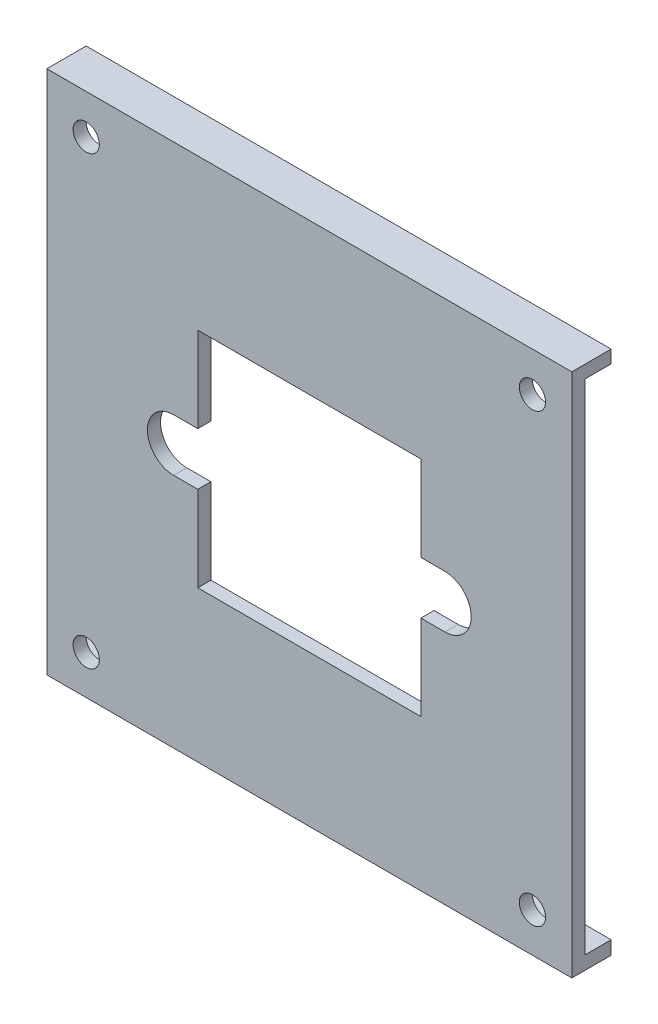
ISO-10303-21;
HEADER;
FILE_DESCRIPTION(('STEP AP214'),'2;1');
FILE_NAME('part.step','',(''),(''),'','','');
FILE_SCHEMA(('AUTOMOTIVE_DESIGN { 1 0 10303 214 1 1 1 1 }'));
ENDSEC;
DATA;
#1=APPLICATION_CONTEXT('core data for automotive mechanical design processes');
#2=APPLICATION_PROTOCOL_DEFINITION('international standard','automotive_design',2000,#1);
#3=PRODUCT_CONTEXT('',#1,'mechanical');
#4=PRODUCT('Part','Part','',(#3));
#5=PRODUCT_RELATED_PRODUCT_CATEGORY('part','',(#4));
#6=PRODUCT_DEFINITION_FORMATION('','',#4);
#7=PRODUCT_DEFINITION_CONTEXT('part definition',#1,'design');
#8=PRODUCT_DEFINITION('design','',#6,#7);
#9=PRODUCT_DEFINITION_SHAPE('','',#8);
#10=(LENGTH_UNIT() NAMED_UNIT(*) SI_UNIT(.MILLI.,.METRE.));
#11=(NAMED_UNIT(*) PLANE_ANGLE_UNIT() SI_UNIT($,.RADIAN.));
#12=(NAMED_UNIT(*) SI_UNIT($,.STERADIAN.) SOLID_ANGLE_UNIT());
#13=UNCERTAINTY_MEASURE_WITH_UNIT(LENGTH_MEASURE(1.E-05),#10,'distance_accuracy_value','');
#14=(GEOMETRIC_REPRESENTATION_CONTEXT(3) GLOBAL_UNCERTAINTY_ASSIGNED_CONTEXT((#13)) GLOBAL_UNIT_ASSIGNED_CONTEXT((#10,
#11,#12)) REPRESENTATION_CONTEXT('',''));
#15=CARTESIAN_POINT('',(0.,0.,0.));
#16=DIRECTION('',(0.,0.,1.));
#17=DIRECTION('',(1.,0.,0.));
#18=AXIS2_PLACEMENT_3D('',#15,#16,#17);
#19=CARTESIAN_POINT('',(28.5,28.5,10.));
#20=DIRECTION('',(1.,0.,0.));
#21=DIRECTION('',(0.,0.,-1.));
#22=AXIS2_PLACEMENT_3D('',#19,#20,#21);
#23=PLANE('',#22);
#24=DIRECTION('',(0.,-1.,0.));
#25=VECTOR('',#24,1.);
#26=CARTESIAN_POINT('',(28.5,28.5,2.));
#27=LINE('',#26,#25);
#28=CARTESIAN_POINT('',(28.5,28.5,2.));
#29=VERTEX_POINT('',#28);
#30=CARTESIAN_POINT('',(28.5,22.,2.));
#31=VERTEX_POINT('',#30);
#32=EDGE_CURVE('E336',#29,#31,#27,.T.);
#33=ORIENTED_EDGE('',*,*,#32,.T.);
#34=DIRECTION('',(0.,0.,1.));
#35=VECTOR('',#34,1.);
#36=CARTESIAN_POINT('',(28.5,22.,0.));
#37=LINE('',#36,#35);
#38=CARTESIAN_POINT('',(28.5,22.,3.));
#39=VERTEX_POINT('',#38);
#40=EDGE_CURVE('E194',#31,#39,#37,.T.);
#41=ORIENTED_EDGE('',*,*,#40,.T.);
#42=DIRECTION('',(0.,-1.,0.));
#43=VECTOR('',#42,1.);
#44=CARTESIAN_POINT('',(28.5,0.,3.));
#45=LINE('',#44,#43);
#46=CARTESIAN_POINT('',(28.5,28.5,3.));
#47=VERTEX_POINT('',#46);
#48=EDGE_CURVE('E211',#47,#39,#45,.T.);
#49=ORIENTED_EDGE('',*,*,#48,.F.);
#50=DIRECTION('',(0.,0.,-1.));
#51=VECTOR('',#50,1.);
#52=CARTESIAN_POINT('',(28.5,28.5,10.));
#53=LINE('',#52,#51);
#54=EDGE_CURVE('E205',#47,#29,#53,.T.);
#55=ORIENTED_EDGE('',*,*,#54,.T.);
#56=EDGE_LOOP('',(#33,#41,#49,#55));
#57=FACE_BOUND('',#56,.T.);
#58=ADVANCED_FACE('F37',(#57),#23,.F.);
#59=CARTESIAN_POINT('',(11.5,28.5,10.));
#60=DIRECTION('',(-1.,0.,0.));
#61=DIRECTION('',(0.,-1.,0.));
#62=AXIS2_PLACEMENT_3D('',#59,#60,#61);
#63=PLANE('',#62);
#64=DIRECTION('',(0.,1.,0.));
#65=VECTOR('',#64,1.);
#66=CARTESIAN_POINT('',(11.5,28.5,2.));
#67=LINE('',#66,#65);
#68=CARTESIAN_POINT('',(11.5,11.5,2.));
#69=VERTEX_POINT('',#68);
#70=CARTESIAN_POINT('',(11.5,18.,2.));
#71=VERTEX_POINT('',#70);
#72=EDGE_CURVE('E330',#69,#71,#67,.T.);
#73=ORIENTED_EDGE('',*,*,#72,.T.);
#74=DIRECTION('',(0.,0.,1.));
#75=VECTOR('',#74,1.);
#76=CARTESIAN_POINT('',(11.5,18.,0.));
#77=LINE('',#76,#75);
#78=CARTESIAN_POINT('',(11.5,18.,3.));
#79=VERTEX_POINT('',#78);
#80=EDGE_CURVE('E282',#71,#79,#77,.T.);
#81=ORIENTED_EDGE('',*,*,#80,.T.);
#82=DIRECTION('',(0.,1.,0.));
#83=VECTOR('',#82,1.);
#84=CARTESIAN_POINT('',(11.5,0.,3.));
#85=LINE('',#84,#83);
#86=CARTESIAN_POINT('',(11.5,11.5,3.));
#87=VERTEX_POINT('',#86);
#88=EDGE_CURVE('E200',#87,#79,#85,.T.);
#89=ORIENTED_EDGE('',*,*,#88,.F.);
#90=DIRECTION('',(0.,0.,-1.));
#91=VECTOR('',#90,1.);
#92=CARTESIAN_POINT('',(11.5,11.5,10.));
#93=LINE('',#92,#91);
#94=EDGE_CURVE('E355',#87,#69,#93,.T.);
#95=ORIENTED_EDGE('',*,*,#94,.T.);
#96=EDGE_LOOP('',(#73,#81,#89,#95));
#97=FACE_BOUND('',#96,.T.);
#98=ADVANCED_FACE('F369',(#97),#63,.F.);
#99=CARTESIAN_POINT('',(0.,0.,0.));
#100=DIRECTION('',(0.,0.,-1.));
#101=DIRECTION('',(-1.,0.,0.));
#102=AXIS2_PLACEMENT_3D('',#99,#100,#101);
#103=PLANE('',#102);
#104=DIRECTION('',(1.,0.,0.));
#105=VECTOR('',#104,1.);
#106=CARTESIAN_POINT('',(0.,1.02489497807123,0.));
#107=LINE('',#106,#105);
#108=CARTESIAN_POINT('',(0.,1.02489497807123,0.));
#109=VERTEX_POINT('',#108);
#110=CARTESIAN_POINT('',(40.,1.02489497807124,0.));
#111=VERTEX_POINT('',#110);
#112=EDGE_CURVE('E321',#109,#111,#107,.T.);
#113=ORIENTED_EDGE('',*,*,#112,.T.);
#114=DIRECTION('',(0.,1.,0.));
#115=VECTOR('',#114,1.);
#116=CARTESIAN_POINT('',(40.,40.,0.));
#117=LINE('',#116,#115);
#118=CARTESIAN_POINT('',(40.,0.,0.));
#119=VERTEX_POINT('',#118);
#120=EDGE_CURVE('E241',#119,#111,#117,.T.);
#121=ORIENTED_EDGE('',*,*,#120,.F.);
#122=DIRECTION('',(1.,0.,0.));
#123=VECTOR('',#122,1.);
#124=CARTESIAN_POINT('',(40.,0.,0.));
#125=LINE('',#124,#123);
#126=CARTESIAN_POINT('',(0.,0.,0.));
#127=VERTEX_POINT('',#126);
#128=EDGE_CURVE('E226',#127,#119,#125,.T.);
#129=ORIENTED_EDGE('',*,*,#128,.F.);
#130=DIRECTION('',(0.,-1.,0.));
#131=VECTOR('',#130,1.);
#132=CARTESIAN_POINT('',(0.,0.,0.));
#133=LINE('',#132,#131);
#134=EDGE_CURVE('E246',#109,#127,#133,.T.);
#135=ORIENTED_EDGE('',*,*,#134,.F.);
#136=EDGE_LOOP('',(#113,#121,#129,#135));
#137=FACE_BOUND('',#136,.T.);
#138=ADVANCED_FACE('F399',(#137),#103,.T.);
#139=CARTESIAN_POINT('',(40.,0.,3.));
#140=DIRECTION('',(0.,1.,0.));
#141=DIRECTION('',(-1.,0.,0.));
#142=AXIS2_PLACEMENT_3D('',#139,#140,#141);
#143=PLANE('',#142);
#144=ORIENTED_EDGE('',*,*,#128,.T.);
#145=DIRECTION('',(0.,0.,-1.));
#146=VECTOR('',#145,1.);
#147=CARTESIAN_POINT('',(40.,0.,3.));
#148=LINE('',#147,#146);
#149=CARTESIAN_POINT('',(40.,0.,3.));
#150=VERTEX_POINT('',#149);
#151=EDGE_CURVE('E257',#150,#119,#148,.T.);
#152=ORIENTED_EDGE('',*,*,#151,.F.);
#153=DIRECTION('',(1.,0.,0.));
#154=VECTOR('',#153,1.);
#155=CARTESIAN_POINT('',(40.,0.,3.));
#156=LINE('',#155,#154);
#157=CARTESIAN_POINT('',(0.,0.,3.));
#158=VERTEX_POINT('',#157);
#159=EDGE_CURVE('E227',#158,#150,#156,.T.);
#160=ORIENTED_EDGE('',*,*,#159,.F.);
#161=DIRECTION('',(0.,0.,-1.));
#162=VECTOR('',#161,1.);
#163=CARTESIAN_POINT('',(0.,0.,3.));
#164=LINE('',#163,#162);
#165=EDGE_CURVE('E237',#158,#127,#164,.T.);
#166=ORIENTED_EDGE('',*,*,#165,.T.);
#167=EDGE_LOOP('',(#144,#152,#160,#166));
#168=FACE_BOUND('',#167,.T.);
#169=ADVANCED_FACE('F39',(#168),#143,.F.);
#170=CARTESIAN_POINT('',(40.,40.,3.));
#171=DIRECTION('',(-1.,0.,0.));
#172=DIRECTION('',(0.,-1.,0.));
#173=AXIS2_PLACEMENT_3D('',#170,#171,#172);
#174=PLANE('',#173);
#175=ORIENTED_EDGE('',*,*,#120,.T.);
#176=DIRECTION('',(0.,0.,-1.));
#177=VECTOR('',#176,1.);
#178=CARTESIAN_POINT('',(40.,1.02489497807124,2.));
#179=LINE('',#178,#177);
#180=CARTESIAN_POINT('',(40.,1.02489497807124,2.));
#181=VERTEX_POINT('',#180);
#182=EDGE_CURVE('E308',#181,#111,#179,.T.);
#183=ORIENTED_EDGE('',*,*,#182,.F.);
#184=DIRECTION('',(0.,-1.,0.));
#185=VECTOR('',#184,1.);
#186=CARTESIAN_POINT('',(40.,39.0248949780712,2.));
#187=LINE('',#186,#185);
#188=CARTESIAN_POINT('',(40.,39.0248949780712,2.));
#189=VERTEX_POINT('',#188);
#190=EDGE_CURVE('E317',#189,#181,#187,.T.);
#191=ORIENTED_EDGE('',*,*,#190,.F.);
#192=DIRECTION('',(0.,0.,1.));
#193=VECTOR('',#192,1.);
#194=CARTESIAN_POINT('',(40.,39.0248949780712,0.));
#195=LINE('',#194,#193);
#196=CARTESIAN_POINT('',(40.,39.0248949780712,0.));
#197=VERTEX_POINT('',#196);
#198=EDGE_CURVE('E285',#197,#189,#195,.T.);
#199=ORIENTED_EDGE('',*,*,#198,.F.);
#200=CARTESIAN_POINT('',(40.,40.,0.));
#201=VERTEX_POINT('',#200);
#202=EDGE_CURVE('E240',#197,#201,#117,.T.);
#203=ORIENTED_EDGE('',*,*,#202,.T.);
#204=DIRECTION('',(0.,0.,-1.));
#205=VECTOR('',#204,1.);
#206=CARTESIAN_POINT('',(40.,40.,3.));
#207=LINE('',#206,#205);
#208=CARTESIAN_POINT('',(40.,40.,3.));
#209=VERTEX_POINT('',#208);
#210=EDGE_CURVE('E254',#209,#201,#207,.T.);
#211=ORIENTED_EDGE('',*,*,#210,.F.);
#212=DIRECTION('',(0.,1.,0.));
#213=VECTOR('',#212,1.);
#214=CARTESIAN_POINT('',(40.,40.,3.));
#215=LINE('',#214,#213);
#216=EDGE_CURVE('E230',#150,#209,#215,.T.);
#217=ORIENTED_EDGE('',*,*,#216,.F.);
#218=ORIENTED_EDGE('',*,*,#151,.T.);
#219=EDGE_LOOP('',(#175,#183,#191,#199,#203,#211,#217,#218));
#220=FACE_BOUND('',#219,.T.);
#221=ADVANCED_FACE('F429',(#220),#174,.F.);
#222=CARTESIAN_POINT('',(0.,40.,3.));
#223=DIRECTION('',(0.,-1.,0.));
#224=DIRECTION('',(0.,0.,-1.));
#225=AXIS2_PLACEMENT_3D('',#222,#223,#224);
#226=PLANE('',#225);
#227=DIRECTION('',(-1.,0.,0.));
#228=VECTOR('',#227,1.);
#229=CARTESIAN_POINT('',(0.,40.,0.));
#230=LINE('',#229,#228);
#231=CARTESIAN_POINT('',(0.,40.,0.));
#232=VERTEX_POINT('',#231);
#233=EDGE_CURVE('E244',#201,#232,#230,.T.);
#234=ORIENTED_EDGE('',*,*,#233,.T.);
#235=DIRECTION('',(0.,0.,-1.));
#236=VECTOR('',#235,1.);
#237=CARTESIAN_POINT('',(0.,40.,3.));
#238=LINE('',#237,#236);
#239=CARTESIAN_POINT('',(0.,40.,3.));
#240=VERTEX_POINT('',#239);
#241=EDGE_CURVE('E251',#240,#232,#238,.T.);
#242=ORIENTED_EDGE('',*,*,#241,.F.);
#243=DIRECTION('',(-1.,0.,0.));
#244=VECTOR('',#243,1.);
#245=CARTESIAN_POINT('',(0.,40.,3.));
#246=LINE('',#245,#244);
#247=EDGE_CURVE('E233',#209,#240,#246,.T.);
#248=ORIENTED_EDGE('',*,*,#247,.F.);
#249=ORIENTED_EDGE('',*,*,#210,.T.);
#250=EDGE_LOOP('',(#234,#242,#248,#249));
#251=FACE_BOUND('',#250,.T.);
#252=ADVANCED_FACE('F426',(#251),#226,.F.);
#253=CARTESIAN_POINT('',(0.,0.,3.));
#254=DIRECTION('',(1.,0.,0.));
#255=DIRECTION('',(0.,0.,-1.));
#256=AXIS2_PLACEMENT_3D('',#253,#254,#255);
#257=PLANE('',#256);
#258=DIRECTION('',(0.,-1.,0.));
#259=VECTOR('',#258,1.);
#260=CARTESIAN_POINT('',(0.,39.0248949780712,2.));
#261=LINE('',#260,#259);
#262=CARTESIAN_POINT('',(0.,39.0248949780712,2.));
#263=VERTEX_POINT('',#262);
#264=CARTESIAN_POINT('',(0.,1.02489497807123,2.));
#265=VERTEX_POINT('',#264);
#266=EDGE_CURVE('E307',#263,#265,#261,.T.);
#267=ORIENTED_EDGE('',*,*,#266,.T.);
#268=DIRECTION('',(0.,0.,-1.));
#269=VECTOR('',#268,1.);
#270=CARTESIAN_POINT('',(0.,1.02489497807123,2.));
#271=LINE('',#270,#269);
#272=EDGE_CURVE('E311',#265,#109,#271,.T.);
#273=ORIENTED_EDGE('',*,*,#272,.T.);
#274=ORIENTED_EDGE('',*,*,#134,.T.);
#275=ORIENTED_EDGE('',*,*,#165,.F.);
#276=DIRECTION('',(0.,-1.,0.));
#277=VECTOR('',#276,1.);
#278=CARTESIAN_POINT('',(0.,0.,3.));
#279=LINE('',#278,#277);
#280=EDGE_CURVE('E235',#240,#158,#279,.T.);
#281=ORIENTED_EDGE('',*,*,#280,.F.);
#282=ORIENTED_EDGE('',*,*,#241,.T.);
#283=CARTESIAN_POINT('',(0.,39.0248949780712,0.));
#284=VERTEX_POINT('',#283);
#285=EDGE_CURVE('E231',#232,#284,#133,.T.);
#286=ORIENTED_EDGE('',*,*,#285,.T.);
#287=DIRECTION('',(0.,0.,1.));
#288=VECTOR('',#287,1.);
#289=CARTESIAN_POINT('',(0.,39.0248949780712,0.));
#290=LINE('',#289,#288);
#291=EDGE_CURVE('E304',#284,#263,#290,.T.);
#292=ORIENTED_EDGE('',*,*,#291,.T.);
#293=EDGE_LOOP('',(#267,#273,#274,#275,#281,#282,#286,#292));
#294=FACE_BOUND('',#293,.T.);
#295=ADVANCED_FACE('F420',(#294),#257,.F.);
#296=CARTESIAN_POINT('',(0.,0.,3.));
#297=DIRECTION('',(0.,0.,-1.));
#298=DIRECTION('',(-1.,0.,0.));
#299=AXIS2_PLACEMENT_3D('',#296,#297,#298);
#300=PLANE('',#299);
#301=ORIENTED_EDGE('',*,*,#88,.T.);
#302=DIRECTION('',(1.,0.,0.));
#303=VECTOR('',#302,1.);
#304=CARTESIAN_POINT('',(11.5,18.,3.));
#305=LINE('',#304,#303);
#306=CARTESIAN_POINT('',(9.66485434975057,18.,3.));
#307=VERTEX_POINT('',#306);
#308=EDGE_CURVE('E182',#307,#79,#305,.T.);
#309=ORIENTED_EDGE('',*,*,#308,.F.);
#310=CARTESIAN_POINT('',(9.66485434975057,20.,3.));
#311=DIRECTION('',(0.,0.,1.));
#312=DIRECTION('',(1.,0.,0.));
#313=AXIS2_PLACEMENT_3D('',#310,#311,#312);
#314=CIRCLE('',#313,2.);
#315=CARTESIAN_POINT('',(9.66485434975057,22.,3.));
#316=VERTEX_POINT('',#315);
#317=EDGE_CURVE('E193',#316,#307,#314,.T.);
#318=ORIENTED_EDGE('',*,*,#317,.F.);
#319=DIRECTION('',(-1.,0.,0.));
#320=VECTOR('',#319,1.);
#321=CARTESIAN_POINT('',(11.5,22.,3.));
#322=LINE('',#321,#320);
#323=CARTESIAN_POINT('',(11.5,22.,3.));
#324=VERTEX_POINT('',#323);
#325=EDGE_CURVE('E175',#324,#316,#322,.T.);
#326=ORIENTED_EDGE('',*,*,#325,.F.);
#327=CARTESIAN_POINT('',(11.5,28.5,3.));
#328=VERTEX_POINT('',#327);
#329=EDGE_CURVE('E189',#324,#328,#85,.T.);
#330=ORIENTED_EDGE('',*,*,#329,.T.);
#331=DIRECTION('',(1.,0.,0.));
#332=VECTOR('',#331,1.);
#333=CARTESIAN_POINT('',(0.,28.5,3.));
#334=LINE('',#333,#332);
#335=EDGE_CURVE('E203',#328,#47,#334,.T.);
#336=ORIENTED_EDGE('',*,*,#335,.T.);
#337=ORIENTED_EDGE('',*,*,#48,.T.);
#338=DIRECTION('',(-1.,0.,0.));
#339=VECTOR('',#338,1.);
#340=CARTESIAN_POINT('',(28.5,22.,3.));
#341=LINE('',#340,#339);
#342=CARTESIAN_POINT('',(30.3351456502494,22.,3.));
#343=VERTEX_POINT('',#342);
#344=EDGE_CURVE('E295',#343,#39,#341,.T.);
#345=ORIENTED_EDGE('',*,*,#344,.F.);
#346=CARTESIAN_POINT('',(30.3351456502494,20.,3.));
#347=DIRECTION('',(0.,0.,1.));
#348=DIRECTION('',(-1.,0.,0.));
#349=AXIS2_PLACEMENT_3D('',#346,#347,#348);
#350=CIRCLE('',#349,2.);
#351=CARTESIAN_POINT('',(30.3351456502494,18.,3.));
#352=VERTEX_POINT('',#351);
#353=EDGE_CURVE('E292',#352,#343,#350,.T.);
#354=ORIENTED_EDGE('',*,*,#353,.F.);
#355=DIRECTION('',(1.,0.,0.));
#356=VECTOR('',#355,1.);
#357=CARTESIAN_POINT('',(28.5,18.,3.));
#358=LINE('',#357,#356);
#359=CARTESIAN_POINT('',(28.5,18.,3.));
#360=VERTEX_POINT('',#359);
#361=EDGE_CURVE('E290',#360,#352,#358,.T.);
#362=ORIENTED_EDGE('',*,*,#361,.F.);
#363=CARTESIAN_POINT('',(28.5,11.5,3.));
#364=VERTEX_POINT('',#363);
#365=EDGE_CURVE('E210',#360,#364,#45,.T.);
#366=ORIENTED_EDGE('',*,*,#365,.T.);
#367=DIRECTION('',(-1.,0.,0.));
#368=VECTOR('',#367,1.);
#369=CARTESIAN_POINT('',(0.,11.5,3.));
#370=LINE('',#369,#368);
#371=EDGE_CURVE('E201',#364,#87,#370,.T.);
#372=ORIENTED_EDGE('',*,*,#371,.T.);
#373=EDGE_LOOP('',(#301,#309,#318,#326,#330,#336,#337,#345,#354,#362,#366,#372));
#374=FACE_BOUND('',#373,.T.);
#375=CARTESIAN_POINT('',(3.,3.,3.));
#376=DIRECTION('',(0.,0.,1.));
#377=DIRECTION('',(1.,0.,0.));
#378=AXIS2_PLACEMENT_3D('',#375,#376,#377);
#379=CIRCLE('',#378,1.);
#380=CARTESIAN_POINT('',(4.,3.,3.));
#381=VERTEX_POINT('',#380);
#382=EDGE_CURVE('E218',#381,#381,#379,.T.);
#383=ORIENTED_EDGE('',*,*,#382,.F.);
#384=EDGE_LOOP('',(#383));
#385=FACE_BOUND('',#384,.T.);
#386=CARTESIAN_POINT('',(37.,37.,3.));
#387=DIRECTION('',(0.,0.,1.));
#388=DIRECTION('',(1.,0.,0.));
#389=AXIS2_PLACEMENT_3D('',#386,#387,#388);
#390=CIRCLE('',#389,0.999999999999998);
#391=CARTESIAN_POINT('',(38.,37.,3.));
#392=VERTEX_POINT('',#391);
#393=EDGE_CURVE('E217',#392,#392,#390,.T.);
#394=ORIENTED_EDGE('',*,*,#393,.F.);
#395=EDGE_LOOP('',(#394));
#396=FACE_BOUND('',#395,.T.);
#397=CARTESIAN_POINT('',(37.,3.,3.));
#398=DIRECTION('',(0.,0.,1.));
#399=DIRECTION('',(1.,0.,0.));
#400=AXIS2_PLACEMENT_3D('',#397,#398,#399);
#401=CIRCLE('',#400,0.999999999999998);
#402=CARTESIAN_POINT('',(38.,3.,3.));
#403=VERTEX_POINT('',#402);
#404=EDGE_CURVE('E214',#403,#403,#401,.T.);
#405=ORIENTED_EDGE('',*,*,#404,.F.);
#406=EDGE_LOOP('',(#405));
#407=FACE_BOUND('',#406,.T.);
#408=CARTESIAN_POINT('',(3.,37.,3.));
#409=DIRECTION('',(0.,0.,1.));
#410=DIRECTION('',(1.,0.,0.));
#411=AXIS2_PLACEMENT_3D('',#408,#409,#410);
#412=CIRCLE('',#411,1.);
#413=CARTESIAN_POINT('',(4.,37.,3.));
#414=VERTEX_POINT('',#413);
#415=EDGE_CURVE('E221',#414,#414,#412,.T.);
#416=ORIENTED_EDGE('',*,*,#415,.F.);
#417=EDGE_LOOP('',(#416));
#418=FACE_BOUND('',#417,.T.);
#419=ORIENTED_EDGE('',*,*,#159,.T.);
#420=ORIENTED_EDGE('',*,*,#216,.T.);
#421=ORIENTED_EDGE('',*,*,#247,.T.);
#422=ORIENTED_EDGE('',*,*,#280,.T.);
#423=EDGE_LOOP('',(#419,#420,#421,#422));
#424=FACE_BOUND('',#423,.T.);
#425=ADVANCED_FACE('F186',(#374,#385,#396,#407,#418,#424),#300,.F.);
#426=DIRECTION('',(1.,0.,0.));
#427=VECTOR('',#426,1.);
#428=CARTESIAN_POINT('',(0.,39.0248949780712,0.));
#429=LINE('',#428,#427);
#430=EDGE_CURVE('E314',#284,#197,#429,.T.);
#431=ORIENTED_EDGE('',*,*,#430,.F.);
#432=ORIENTED_EDGE('',*,*,#285,.F.);
#433=ORIENTED_EDGE('',*,*,#233,.F.);
#434=ORIENTED_EDGE('',*,*,#202,.F.);
#435=EDGE_LOOP('',(#431,#432,#433,#434));
#436=FACE_BOUND('',#435,.T.);
#437=ADVANCED_FACE('F416',(#436),#103,.T.);
#438=CARTESIAN_POINT('',(3.,37.,-7.));
#439=DIRECTION('',(0.,0.,1.));
#440=DIRECTION('',(1.,0.,0.));
#441=AXIS2_PLACEMENT_3D('',#438,#439,#440);
#442=CYLINDRICAL_SURFACE('',#441,1.);
#443=CARTESIAN_POINT('',(3.,37.,2.));
#444=DIRECTION('',(0.,0.,1.));
#445=DIRECTION('',(0.,-1.,0.));
#446=AXIS2_PLACEMENT_3D('',#443,#444,#445);
#447=CIRCLE('',#446,1.);
#448=CARTESIAN_POINT('',(3.,36.,2.));
#449=VERTEX_POINT('',#448);
#450=EDGE_CURVE('E348',#449,#449,#447,.F.);
#451=ORIENTED_EDGE('',*,*,#450,.T.);
#452=EDGE_LOOP('',(#451));
#453=FACE_BOUND('',#452,.T.);
#454=ORIENTED_EDGE('',*,*,#415,.T.);
#455=EDGE_LOOP('',(#454));
#456=FACE_BOUND('',#455,.T.);
#457=ADVANCED_FACE('F406',(#453,#456),#442,.F.);
#458=CARTESIAN_POINT('',(37.,3.,-7.));
#459=DIRECTION('',(0.,0.,1.));
#460=DIRECTION('',(1.,0.,0.));
#461=AXIS2_PLACEMENT_3D('',#458,#459,#460);
#462=CYLINDRICAL_SURFACE('',#461,0.999999999999998);
#463=CARTESIAN_POINT('',(37.,3.,2.));
#464=DIRECTION('',(0.,0.,1.));
#465=DIRECTION('',(0.,-1.,0.));
#466=AXIS2_PLACEMENT_3D('',#463,#464,#465);
#467=CIRCLE('',#466,0.999999999999998);
#468=CARTESIAN_POINT('',(37.,2.,2.));
#469=VERTEX_POINT('',#468);
#470=EDGE_CURVE('E345',#469,#469,#467,.F.);
#471=ORIENTED_EDGE('',*,*,#470,.T.);
#472=EDGE_LOOP('',(#471));
#473=FACE_BOUND('',#472,.T.);
#474=ORIENTED_EDGE('',*,*,#404,.T.);
#475=EDGE_LOOP('',(#474));
#476=FACE_BOUND('',#475,.T.);
#477=ADVANCED_FACE('F402',(#473,#476),#462,.F.);
#478=CARTESIAN_POINT('',(37.,37.,-7.));
#479=DIRECTION('',(0.,0.,1.));
#480=DIRECTION('',(1.,0.,0.));
#481=AXIS2_PLACEMENT_3D('',#478,#479,#480);
#482=CYLINDRICAL_SURFACE('',#481,0.999999999999998);
#483=CARTESIAN_POINT('',(37.,37.,2.));
#484=DIRECTION('',(0.,0.,1.));
#485=DIRECTION('',(0.,-1.,0.));
#486=AXIS2_PLACEMENT_3D('',#483,#484,#485);
#487=CIRCLE('',#486,0.999999999999998);
#488=CARTESIAN_POINT('',(37.,36.,2.));
#489=VERTEX_POINT('',#488);
#490=EDGE_CURVE('E342',#489,#489,#487,.F.);
#491=ORIENTED_EDGE('',*,*,#490,.T.);
#492=EDGE_LOOP('',(#491));
#493=FACE_BOUND('',#492,.T.);
#494=ORIENTED_EDGE('',*,*,#393,.T.);
#495=EDGE_LOOP('',(#494));
#496=FACE_BOUND('',#495,.T.);
#497=ADVANCED_FACE('F405',(#493,#496),#482,.F.);
#498=CARTESIAN_POINT('',(3.,3.,-7.));
#499=DIRECTION('',(0.,0.,1.));
#500=DIRECTION('',(1.,0.,0.));
#501=AXIS2_PLACEMENT_3D('',#498,#499,#500);
#502=CYLINDRICAL_SURFACE('',#501,1.);
#503=CARTESIAN_POINT('',(3.,3.,2.));
#504=DIRECTION('',(0.,0.,1.));
#505=DIRECTION('',(0.,-1.,0.));
#506=AXIS2_PLACEMENT_3D('',#503,#504,#505);
#507=CIRCLE('',#506,1.);
#508=CARTESIAN_POINT('',(3.,2.,2.));
#509=VERTEX_POINT('',#508);
#510=EDGE_CURVE('E339',#509,#509,#507,.F.);
#511=ORIENTED_EDGE('',*,*,#510,.T.);
#512=EDGE_LOOP('',(#511));
#513=FACE_BOUND('',#512,.T.);
#514=ORIENTED_EDGE('',*,*,#382,.T.);
#515=EDGE_LOOP('',(#514));
#516=FACE_BOUND('',#515,.T.);
#517=ADVANCED_FACE('F392',(#513,#516),#502,.F.);
#518=ORIENTED_EDGE('',*,*,#365,.F.);
#519=DIRECTION('',(0.,0.,1.));
#520=VECTOR('',#519,1.);
#521=CARTESIAN_POINT('',(28.5,18.,0.));
#522=LINE('',#521,#520);
#523=CARTESIAN_POINT('',(28.5,18.,2.));
#524=VERTEX_POINT('',#523);
#525=EDGE_CURVE('E297',#524,#360,#522,.T.);
#526=ORIENTED_EDGE('',*,*,#525,.F.);
#527=CARTESIAN_POINT('',(28.5,11.5,2.));
#528=VERTEX_POINT('',#527);
#529=EDGE_CURVE('E335',#524,#528,#27,.T.);
#530=ORIENTED_EDGE('',*,*,#529,.T.);
#531=DIRECTION('',(0.,0.,-1.));
#532=VECTOR('',#531,1.);
#533=CARTESIAN_POINT('',(28.5,11.5,10.));
#534=LINE('',#533,#532);
#535=EDGE_CURVE('E351',#364,#528,#534,.T.);
#536=ORIENTED_EDGE('',*,*,#535,.F.);
#537=EDGE_LOOP('',(#518,#526,#530,#536));
#538=FACE_BOUND('',#537,.T.);
#539=ADVANCED_FACE('F365',(#538),#23,.F.);
#540=CARTESIAN_POINT('',(28.5,28.5,10.));
#541=DIRECTION('',(0.,1.,0.));
#542=DIRECTION('',(0.,0.,1.));
#543=AXIS2_PLACEMENT_3D('',#540,#541,#542);
#544=PLANE('',#543);
#545=DIRECTION('',(0.,0.,-1.));
#546=VECTOR('',#545,1.);
#547=CARTESIAN_POINT('',(11.5,28.5,10.));
#548=LINE('',#547,#546);
#549=CARTESIAN_POINT('',(11.5,28.5,2.));
#550=VERTEX_POINT('',#549);
#551=EDGE_CURVE('E199',#328,#550,#548,.T.);
#552=ORIENTED_EDGE('',*,*,#551,.T.);
#553=DIRECTION('',(1.,0.,0.));
#554=VECTOR('',#553,1.);
#555=CARTESIAN_POINT('',(28.5,28.5,2.));
#556=LINE('',#555,#554);
#557=EDGE_CURVE('E332',#550,#29,#556,.T.);
#558=ORIENTED_EDGE('',*,*,#557,.T.);
#559=ORIENTED_EDGE('',*,*,#54,.F.);
#560=ORIENTED_EDGE('',*,*,#335,.F.);
#561=EDGE_LOOP('',(#552,#558,#559,#560));
#562=FACE_BOUND('',#561,.T.);
#563=ADVANCED_FACE('F383',(#562),#544,.F.);
#564=ORIENTED_EDGE('',*,*,#329,.F.);
#565=DIRECTION('',(0.,0.,1.));
#566=VECTOR('',#565,1.);
#567=CARTESIAN_POINT('',(11.5,22.,0.));
#568=LINE('',#567,#566);
#569=CARTESIAN_POINT('',(11.5,22.,2.));
#570=VERTEX_POINT('',#569);
#571=EDGE_CURVE('E172',#570,#324,#568,.T.);
#572=ORIENTED_EDGE('',*,*,#571,.F.);
#573=EDGE_CURVE('E324',#570,#550,#67,.T.);
#574=ORIENTED_EDGE('',*,*,#573,.T.);
#575=ORIENTED_EDGE('',*,*,#551,.F.);
#576=EDGE_LOOP('',(#564,#572,#574,#575));
#577=FACE_BOUND('',#576,.T.);
#578=ADVANCED_FACE('F197',(#577),#63,.F.);
#579=CARTESIAN_POINT('',(28.5,11.5,10.));
#580=DIRECTION('',(0.,-1.,0.));
#581=DIRECTION('',(1.,0.,0.));
#582=AXIS2_PLACEMENT_3D('',#579,#580,#581);
#583=PLANE('',#582);
#584=ORIENTED_EDGE('',*,*,#535,.T.);
#585=DIRECTION('',(-1.,0.,0.));
#586=VECTOR('',#585,1.);
#587=CARTESIAN_POINT('',(28.5,11.5,2.));
#588=LINE('',#587,#586);
#589=EDGE_CURVE('E260',#528,#69,#588,.T.);
#590=ORIENTED_EDGE('',*,*,#589,.T.);
#591=ORIENTED_EDGE('',*,*,#94,.F.);
#592=ORIENTED_EDGE('',*,*,#371,.F.);
#593=EDGE_LOOP('',(#584,#590,#591,#592));
#594=FACE_BOUND('',#593,.T.);
#595=ADVANCED_FACE('F361',(#594),#583,.F.);
#596=CARTESIAN_POINT('',(0.,39.0248949780712,2.));
#597=DIRECTION('',(0.,0.,1.));
#598=DIRECTION('',(0.,-1.,0.));
#599=AXIS2_PLACEMENT_3D('',#596,#597,#598);
#600=PLANE('',#599);
#601=ORIENTED_EDGE('',*,*,#470,.F.);
#602=EDGE_LOOP('',(#601));
#603=FACE_BOUND('',#602,.T.);
#604=ORIENTED_EDGE('',*,*,#510,.F.);
#605=EDGE_LOOP('',(#604));
#606=FACE_BOUND('',#605,.T.);
#607=ORIENTED_EDGE('',*,*,#190,.T.);
#608=DIRECTION('',(1.,0.,0.));
#609=VECTOR('',#608,1.);
#610=CARTESIAN_POINT('',(0.,1.02489497807123,2.));
#611=LINE('',#610,#609);
#612=EDGE_CURVE('E325',#265,#181,#611,.T.);
#613=ORIENTED_EDGE('',*,*,#612,.F.);
#614=ORIENTED_EDGE('',*,*,#266,.F.);
#615=DIRECTION('',(1.,0.,0.));
#616=VECTOR('',#615,1.);
#617=CARTESIAN_POINT('',(0.,39.0248949780712,2.));
#618=LINE('',#617,#616);
#619=EDGE_CURVE('E327',#263,#189,#618,.T.);
#620=ORIENTED_EDGE('',*,*,#619,.T.);
#621=EDGE_LOOP('',(#607,#613,#614,#620));
#622=FACE_BOUND('',#621,.T.);
#623=CARTESIAN_POINT('',(9.66485434975057,20.,2.));
#624=DIRECTION('',(0.,0.,1.));
#625=DIRECTION('',(0.,-1.,0.));
#626=AXIS2_PLACEMENT_3D('',#623,#624,#625);
#627=CIRCLE('',#626,2.);
#628=CARTESIAN_POINT('',(9.66485434975057,22.,2.));
#629=VERTEX_POINT('',#628);
#630=CARTESIAN_POINT('',(9.66485434975057,18.,2.));
#631=VERTEX_POINT('',#630);
#632=EDGE_CURVE('E45',#629,#631,#627,.T.);
#633=ORIENTED_EDGE('',*,*,#632,.T.);
#634=DIRECTION('',(1.,0.,0.));
#635=VECTOR('',#634,1.);
#636=CARTESIAN_POINT('',(0.,18.,2.));
#637=LINE('',#636,#635);
#638=EDGE_CURVE('E11',#631,#71,#637,.T.);
#639=ORIENTED_EDGE('',*,*,#638,.T.);
#640=ORIENTED_EDGE('',*,*,#72,.F.);
#641=ORIENTED_EDGE('',*,*,#589,.F.);
#642=ORIENTED_EDGE('',*,*,#529,.F.);
#643=DIRECTION('',(1.,0.,0.));
#644=VECTOR('',#643,1.);
#645=CARTESIAN_POINT('',(0.,17.9999999999999,2.));
#646=LINE('',#645,#644);
#647=CARTESIAN_POINT('',(30.3351456502494,18.,2.));
#648=VERTEX_POINT('',#647);
#649=EDGE_CURVE('E263',#524,#648,#646,.T.);
#650=ORIENTED_EDGE('',*,*,#649,.T.);
#651=CARTESIAN_POINT('',(30.3351456502494,20.,2.));
#652=DIRECTION('',(0.,0.,1.));
#653=DIRECTION('',(0.,-1.,0.));
#654=AXIS2_PLACEMENT_3D('',#651,#652,#653);
#655=CIRCLE('',#654,2.);
#656=CARTESIAN_POINT('',(30.3351456502494,22.,2.));
#657=VERTEX_POINT('',#656);
#658=EDGE_CURVE('E266',#648,#657,#655,.T.);
#659=ORIENTED_EDGE('',*,*,#658,.T.);
#660=DIRECTION('',(-1.,0.,0.));
#661=VECTOR('',#660,1.);
#662=CARTESIAN_POINT('',(0.,21.9999999999999,2.));
#663=LINE('',#662,#661);
#664=EDGE_CURVE('E269',#657,#31,#663,.T.);
#665=ORIENTED_EDGE('',*,*,#664,.T.);
#666=ORIENTED_EDGE('',*,*,#32,.F.);
#667=ORIENTED_EDGE('',*,*,#557,.F.);
#668=ORIENTED_EDGE('',*,*,#573,.F.);
#669=DIRECTION('',(-1.,0.,0.));
#670=VECTOR('',#669,1.);
#671=CARTESIAN_POINT('',(0.,22.,2.));
#672=LINE('',#671,#670);
#673=EDGE_CURVE('E178',#570,#629,#672,.T.);
#674=ORIENTED_EDGE('',*,*,#673,.T.);
#675=EDGE_LOOP('',(#633,#639,#640,#641,#642,#650,#659,#665,#666,#667,#668,#674));
#676=FACE_BOUND('',#675,.T.);
#677=ORIENTED_EDGE('',*,*,#490,.F.);
#678=EDGE_LOOP('',(#677));
#679=FACE_BOUND('',#678,.T.);
#680=ORIENTED_EDGE('',*,*,#450,.F.);
#681=EDGE_LOOP('',(#680));
#682=FACE_BOUND('',#681,.T.);
#683=ADVANCED_FACE('F274',(#603,#606,#622,#676,#679,#682),#600,.F.);
#684=CARTESIAN_POINT('',(0.,1.02489497807123,2.));
#685=DIRECTION('',(0.,-1.,0.));
#686=DIRECTION('',(1.,0.,0.));
#687=AXIS2_PLACEMENT_3D('',#684,#685,#686);
#688=PLANE('',#687);
#689=ORIENTED_EDGE('',*,*,#182,.T.);
#690=ORIENTED_EDGE('',*,*,#112,.F.);
#691=ORIENTED_EDGE('',*,*,#272,.F.);
#692=ORIENTED_EDGE('',*,*,#612,.T.);
#693=EDGE_LOOP('',(#689,#690,#691,#692));
#694=FACE_BOUND('',#693,.T.);
#695=ADVANCED_FACE('F445',(#694),#688,.F.);
#696=CARTESIAN_POINT('',(0.,39.0248949780712,0.));
#697=DIRECTION('',(0.,1.,0.));
#698=DIRECTION('',(-1.,0.,0.));
#699=AXIS2_PLACEMENT_3D('',#696,#697,#698);
#700=PLANE('',#699);
#701=ORIENTED_EDGE('',*,*,#198,.T.);
#702=ORIENTED_EDGE('',*,*,#619,.F.);
#703=ORIENTED_EDGE('',*,*,#291,.F.);
#704=ORIENTED_EDGE('',*,*,#430,.T.);
#705=EDGE_LOOP('',(#701,#702,#703,#704));
#706=FACE_BOUND('',#705,.T.);
#707=ADVANCED_FACE('F461',(#706),#700,.F.);
#708=CARTESIAN_POINT('',(28.5,22.,0.));
#709=DIRECTION('',(0.,1.,0.));
#710=DIRECTION('',(-1.,0.,0.));
#711=AXIS2_PLACEMENT_3D('',#708,#709,#710);
#712=PLANE('',#711);
#713=DIRECTION('',(0.,0.,1.));
#714=VECTOR('',#713,1.);
#715=CARTESIAN_POINT('',(30.3351456502494,22.,0.));
#716=LINE('',#715,#714);
#717=EDGE_CURVE('E300',#657,#343,#716,.T.);
#718=ORIENTED_EDGE('',*,*,#717,.T.);
#719=ORIENTED_EDGE('',*,*,#344,.T.);
#720=ORIENTED_EDGE('',*,*,#40,.F.);
#721=ORIENTED_EDGE('',*,*,#664,.F.);
#722=EDGE_LOOP('',(#718,#719,#720,#721));
#723=FACE_BOUND('',#722,.T.);
#724=ADVANCED_FACE('F379',(#723),#712,.F.);
#725=CARTESIAN_POINT('',(30.3351456502494,20.,0.));
#726=DIRECTION('',(0.,0.,1.));
#727=DIRECTION('',(1.,0.,0.));
#728=AXIS2_PLACEMENT_3D('',#725,#726,#727);
#729=CYLINDRICAL_SURFACE('',#728,2.);
#730=DIRECTION('',(0.,0.,1.));
#731=VECTOR('',#730,1.);
#732=CARTESIAN_POINT('',(30.3351456502494,18.,0.));
#733=LINE('',#732,#731);
#734=EDGE_CURVE('E60',#648,#352,#733,.T.);
#735=ORIENTED_EDGE('',*,*,#734,.T.);
#736=ORIENTED_EDGE('',*,*,#353,.T.);
#737=ORIENTED_EDGE('',*,*,#717,.F.);
#738=ORIENTED_EDGE('',*,*,#658,.F.);
#739=EDGE_LOOP('',(#735,#736,#737,#738));
#740=FACE_BOUND('',#739,.T.);
#741=ADVANCED_FACE('F377',(#740),#729,.F.);
#742=CARTESIAN_POINT('',(28.5,18.,0.));
#743=DIRECTION('',(0.,-1.,0.));
#744=DIRECTION('',(1.,0.,0.));
#745=AXIS2_PLACEMENT_3D('',#742,#743,#744);
#746=PLANE('',#745);
#747=ORIENTED_EDGE('',*,*,#525,.T.);
#748=ORIENTED_EDGE('',*,*,#361,.T.);
#749=ORIENTED_EDGE('',*,*,#734,.F.);
#750=ORIENTED_EDGE('',*,*,#649,.F.);
#751=EDGE_LOOP('',(#747,#748,#749,#750));
#752=FACE_BOUND('',#751,.T.);
#753=ADVANCED_FACE('F374',(#752),#746,.F.);
#754=CARTESIAN_POINT('',(11.5,18.,0.));
#755=DIRECTION('',(0.,-1.,0.));
#756=DIRECTION('',(1.,0.,0.));
#757=AXIS2_PLACEMENT_3D('',#754,#755,#756);
#758=PLANE('',#757);
#759=DIRECTION('',(0.,0.,1.));
#760=VECTOR('',#759,1.);
#761=CARTESIAN_POINT('',(9.66485434975057,18.,0.));
#762=LINE('',#761,#760);
#763=EDGE_CURVE('E280',#631,#307,#762,.T.);
#764=ORIENTED_EDGE('',*,*,#763,.T.);
#765=ORIENTED_EDGE('',*,*,#308,.T.);
#766=ORIENTED_EDGE('',*,*,#80,.F.);
#767=ORIENTED_EDGE('',*,*,#638,.F.);
#768=EDGE_LOOP('',(#764,#765,#766,#767));
#769=FACE_BOUND('',#768,.T.);
#770=ADVANCED_FACE('F475',(#769),#758,.F.);
#771=CARTESIAN_POINT('',(9.66485434975057,20.,0.));
#772=DIRECTION('',(0.,0.,1.));
#773=DIRECTION('',(1.,0.,0.));
#774=AXIS2_PLACEMENT_3D('',#771,#772,#773);
#775=CYLINDRICAL_SURFACE('',#774,2.);
#776=DIRECTION('',(0.,0.,1.));
#777=VECTOR('',#776,1.);
#778=CARTESIAN_POINT('',(9.66485434975057,22.,0.));
#779=LINE('',#778,#777);
#780=EDGE_CURVE('E52',#629,#316,#779,.T.);
#781=ORIENTED_EDGE('',*,*,#780,.T.);
#782=ORIENTED_EDGE('',*,*,#317,.T.);
#783=ORIENTED_EDGE('',*,*,#763,.F.);
#784=ORIENTED_EDGE('',*,*,#632,.F.);
#785=EDGE_LOOP('',(#781,#782,#783,#784));
#786=FACE_BOUND('',#785,.T.);
#787=ADVANCED_FACE('F279',(#786),#775,.F.);
#788=CARTESIAN_POINT('',(11.5,22.,0.));
#789=DIRECTION('',(0.,1.,0.));
#790=DIRECTION('',(-1.,0.,0.));
#791=AXIS2_PLACEMENT_3D('',#788,#789,#790);
#792=PLANE('',#791);
#793=ORIENTED_EDGE('',*,*,#571,.T.);
#794=ORIENTED_EDGE('',*,*,#325,.T.);
#795=ORIENTED_EDGE('',*,*,#780,.F.);
#796=ORIENTED_EDGE('',*,*,#673,.F.);
#797=EDGE_LOOP('',(#793,#794,#795,#796));
#798=FACE_BOUND('',#797,.T.);
#799=ADVANCED_FACE('F174',(#798),#792,.F.);
#800=CLOSED_SHELL('',(#58,#98,#138,#169,#221,#252,#295,#425,#437,#457,#477,#497,#517,#539,#563,
#578,#595,#683,#695,#707,#724,#741,#753,#770,#787,#799));
#801=MANIFOLD_SOLID_BREP('B2',#800);
#802=ADVANCED_BREP_SHAPE_REPRESENTATION('',(#18,#801),#14);
#803=SHAPE_DEFINITION_REPRESENTATION(#9,#802);
ENDSEC;
END-ISO-10303-21;
